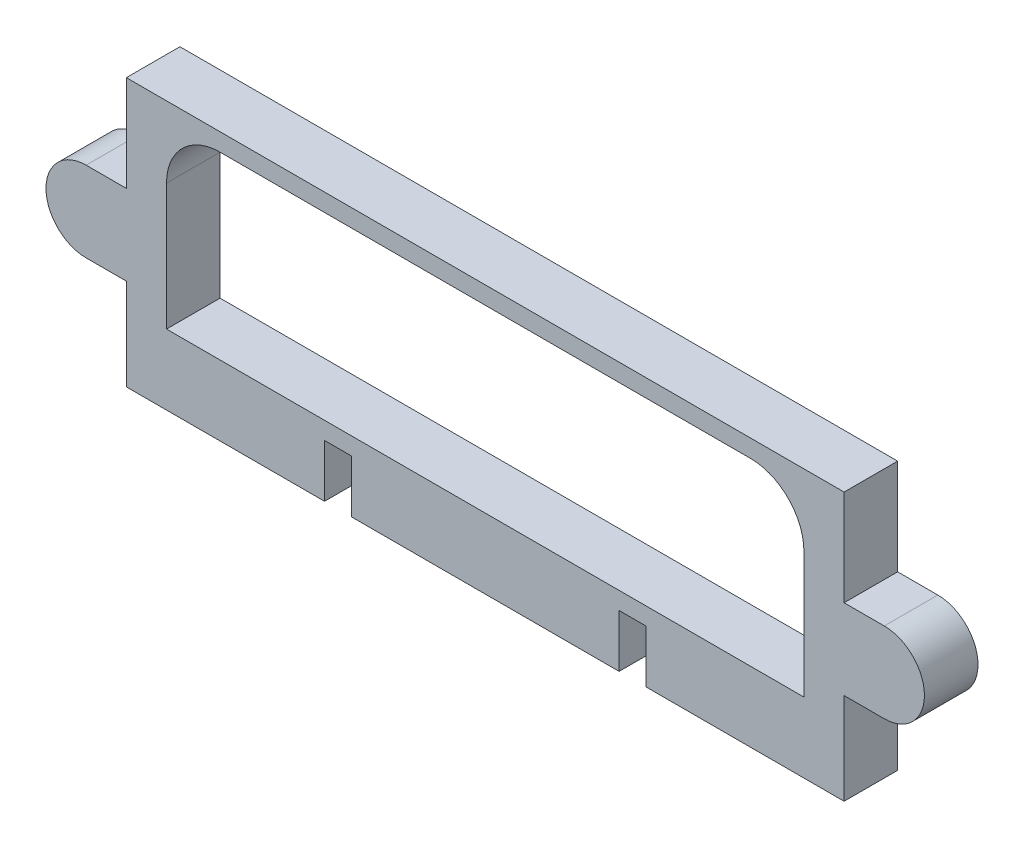
ISO-10303-21;
HEADER;
FILE_DESCRIPTION(('STEP AP214'),'2;1');
FILE_NAME('part.step','',(''),(''),'','','');
FILE_SCHEMA(('AUTOMOTIVE_DESIGN { 1 0 10303 214 1 1 1 1 }'));
ENDSEC;
DATA;
#1=APPLICATION_CONTEXT('core data for automotive mechanical design processes');
#2=APPLICATION_PROTOCOL_DEFINITION('international standard','automotive_design',2000,#1);
#3=PRODUCT_CONTEXT('',#1,'mechanical');
#4=PRODUCT('Part','Part','',(#3));
#5=PRODUCT_RELATED_PRODUCT_CATEGORY('part','',(#4));
#6=PRODUCT_DEFINITION_FORMATION('','',#4);
#7=PRODUCT_DEFINITION_CONTEXT('part definition',#1,'design');
#8=PRODUCT_DEFINITION('design','',#6,#7);
#9=PRODUCT_DEFINITION_SHAPE('','',#8);
#10=(LENGTH_UNIT() NAMED_UNIT(*) SI_UNIT(.MILLI.,.METRE.));
#11=(NAMED_UNIT(*) PLANE_ANGLE_UNIT() SI_UNIT($,.RADIAN.));
#12=(NAMED_UNIT(*) SI_UNIT($,.STERADIAN.) SOLID_ANGLE_UNIT());
#13=UNCERTAINTY_MEASURE_WITH_UNIT(LENGTH_MEASURE(1.E-05),#10,'distance_accuracy_value','');
#14=(GEOMETRIC_REPRESENTATION_CONTEXT(3) GLOBAL_UNCERTAINTY_ASSIGNED_CONTEXT((#13)) GLOBAL_UNIT_ASSIGNED_CONTEXT((#10,
#11,#12)) REPRESENTATION_CONTEXT('',''));
#15=CARTESIAN_POINT('',(0.,0.,0.));
#16=DIRECTION('',(0.,0.,1.));
#17=DIRECTION('',(1.,0.,0.));
#18=AXIS2_PLACEMENT_3D('',#15,#16,#17);
#19=CARTESIAN_POINT('',(74.5,24.5975679815042,10.));
#20=DIRECTION('',(0.,0.,-1.));
#21=DIRECTION('',(-1.,0.,0.));
#22=AXIS2_PLACEMENT_3D('',#19,#20,#21);
#23=CYLINDRICAL_SURFACE('',#22,7.50000000000001);
#24=CARTESIAN_POINT('',(74.5,24.5975679815042,0.));
#25=DIRECTION('',(0.,0.,1.));
#26=DIRECTION('',(1.,0.,0.));
#27=AXIS2_PLACEMENT_3D('',#24,#25,#26);
#28=CIRCLE('',#27,7.50000000000001);
#29=CARTESIAN_POINT('',(74.5,32.0975679815042,0.));
#30=VERTEX_POINT('',#29);
#31=CARTESIAN_POINT('',(74.5,17.0975679815042,0.));
#32=VERTEX_POINT('',#31);
#33=EDGE_CURVE('E352',#30,#32,#28,.F.);
#34=ORIENTED_EDGE('',*,*,#33,.F.);
#35=DIRECTION('',(0.,0.,-1.));
#36=VECTOR('',#35,1.);
#37=CARTESIAN_POINT('',(74.5,32.0975679815042,10.));
#38=LINE('',#37,#36);
#39=CARTESIAN_POINT('',(74.5,32.0975679815042,10.));
#40=VERTEX_POINT('',#39);
#41=EDGE_CURVE('E11',#40,#30,#38,.T.);
#42=ORIENTED_EDGE('',*,*,#41,.F.);
#43=CARTESIAN_POINT('',(74.5,24.5975679815042,10.));
#44=DIRECTION('',(0.,0.,1.));
#45=DIRECTION('',(1.,0.,0.));
#46=AXIS2_PLACEMENT_3D('',#43,#44,#45);
#47=CIRCLE('',#46,7.50000000000001);
#48=CARTESIAN_POINT('',(74.5,17.0975679815042,10.));
#49=VERTEX_POINT('',#48);
#50=EDGE_CURVE('E414',#40,#49,#47,.F.);
#51=ORIENTED_EDGE('',*,*,#50,.T.);
#52=DIRECTION('',(0.,0.,-1.));
#53=VECTOR('',#52,1.);
#54=CARTESIAN_POINT('',(74.5,17.0975679815042,10.));
#55=LINE('',#54,#53);
#56=EDGE_CURVE('E146',#49,#32,#55,.T.);
#57=ORIENTED_EDGE('',*,*,#56,.T.);
#58=EDGE_LOOP('',(#34,#42,#51,#57));
#59=FACE_BOUND('',#58,.T.);
#60=ADVANCED_FACE('F39',(#59),#23,.T.);
#61=CARTESIAN_POINT('',(0.,32.0975679815042,10.));
#62=DIRECTION('',(0.,1.,0.));
#63=DIRECTION('',(0.,0.,1.));
#64=AXIS2_PLACEMENT_3D('',#61,#62,#63);
#65=PLANE('',#64);
#66=DIRECTION('',(1.,0.,0.));
#67=VECTOR('',#66,1.);
#68=CARTESIAN_POINT('',(0.,32.0975679815042,0.));
#69=LINE('',#68,#67);
#70=CARTESIAN_POINT('',(67.,32.0975679815042,0.));
#71=VERTEX_POINT('',#70);
#72=EDGE_CURVE('E349',#71,#30,#69,.T.);
#73=ORIENTED_EDGE('',*,*,#72,.F.);
#74=DIRECTION('',(0.,0.,-1.));
#75=VECTOR('',#74,1.);
#76=CARTESIAN_POINT('',(67.,32.0975679815042,10.));
#77=LINE('',#76,#75);
#78=CARTESIAN_POINT('',(67.,32.0975679815042,10.));
#79=VERTEX_POINT('',#78);
#80=EDGE_CURVE('E49',#79,#71,#77,.T.);
#81=ORIENTED_EDGE('',*,*,#80,.F.);
#82=DIRECTION('',(1.,0.,0.));
#83=VECTOR('',#82,1.);
#84=CARTESIAN_POINT('',(0.,32.0975679815042,10.));
#85=LINE('',#84,#83);
#86=EDGE_CURVE('E411',#79,#40,#85,.T.);
#87=ORIENTED_EDGE('',*,*,#86,.T.);
#88=ORIENTED_EDGE('',*,*,#41,.T.);
#89=EDGE_LOOP('',(#73,#81,#87,#88));
#90=FACE_BOUND('',#89,.T.);
#91=ADVANCED_FACE('F460',(#90),#65,.T.);
#92=CARTESIAN_POINT('',(67.,0.,10.));
#93=DIRECTION('',(-1.,0.,0.));
#94=DIRECTION('',(0.,0.,1.));
#95=AXIS2_PLACEMENT_3D('',#92,#93,#94);
#96=PLANE('',#95);
#97=DIRECTION('',(0.,1.,0.));
#98=VECTOR('',#97,1.);
#99=CARTESIAN_POINT('',(67.,0.,0.));
#100=LINE('',#99,#98);
#101=CARTESIAN_POINT('',(67.,50.,0.));
#102=VERTEX_POINT('',#101);
#103=EDGE_CURVE('E346',#71,#102,#100,.T.);
#104=ORIENTED_EDGE('',*,*,#103,.T.);
#105=DIRECTION('',(0.,0.,-1.));
#106=VECTOR('',#105,1.);
#107=CARTESIAN_POINT('',(67.,50.,10.));
#108=LINE('',#107,#106);
#109=CARTESIAN_POINT('',(67.,50.,10.));
#110=VERTEX_POINT('',#109);
#111=EDGE_CURVE('E279',#110,#102,#108,.T.);
#112=ORIENTED_EDGE('',*,*,#111,.F.);
#113=DIRECTION('',(0.,1.,0.));
#114=VECTOR('',#113,1.);
#115=CARTESIAN_POINT('',(67.,0.,10.));
#116=LINE('',#115,#114);
#117=EDGE_CURVE('E409',#79,#110,#116,.T.);
#118=ORIENTED_EDGE('',*,*,#117,.F.);
#119=ORIENTED_EDGE('',*,*,#80,.T.);
#120=EDGE_LOOP('',(#104,#112,#118,#119));
#121=FACE_BOUND('',#120,.T.);
#122=ADVANCED_FACE('F464',(#121),#96,.F.);
#123=CARTESIAN_POINT('',(0.,50.,10.));
#124=DIRECTION('',(0.,1.,0.));
#125=DIRECTION('',(0.,0.,1.));
#126=AXIS2_PLACEMENT_3D('',#123,#124,#125);
#127=PLANE('',#126);
#128=DIRECTION('',(1.,0.,0.));
#129=VECTOR('',#128,1.);
#130=CARTESIAN_POINT('',(0.,50.,0.));
#131=LINE('',#130,#129);
#132=CARTESIAN_POINT('',(-67.,50.,0.));
#133=VERTEX_POINT('',#132);
#134=EDGE_CURVE('E343',#133,#102,#131,.T.);
#135=ORIENTED_EDGE('',*,*,#134,.F.);
#136=DIRECTION('',(0.,0.,-1.));
#137=VECTOR('',#136,1.);
#138=CARTESIAN_POINT('',(-67.,50.,10.));
#139=LINE('',#138,#137);
#140=CARTESIAN_POINT('',(-67.,50.,10.));
#141=VERTEX_POINT('',#140);
#142=EDGE_CURVE('E277',#141,#133,#139,.T.);
#143=ORIENTED_EDGE('',*,*,#142,.F.);
#144=DIRECTION('',(1.,0.,0.));
#145=VECTOR('',#144,1.);
#146=CARTESIAN_POINT('',(0.,50.,10.));
#147=LINE('',#146,#145);
#148=EDGE_CURVE('E406',#141,#110,#147,.T.);
#149=ORIENTED_EDGE('',*,*,#148,.T.);
#150=ORIENTED_EDGE('',*,*,#111,.T.);
#151=EDGE_LOOP('',(#135,#143,#149,#150));
#152=FACE_BOUND('',#151,.T.);
#153=ADVANCED_FACE('F470',(#152),#127,.T.);
#154=CARTESIAN_POINT('',(-67.,0.,10.));
#155=DIRECTION('',(-1.,0.,0.));
#156=DIRECTION('',(0.,0.,1.));
#157=AXIS2_PLACEMENT_3D('',#154,#155,#156);
#158=PLANE('',#157);
#159=DIRECTION('',(0.,1.,0.));
#160=VECTOR('',#159,1.);
#161=CARTESIAN_POINT('',(-67.,0.,0.));
#162=LINE('',#161,#160);
#163=CARTESIAN_POINT('',(-67.,32.0975679815042,0.));
#164=VERTEX_POINT('',#163);
#165=EDGE_CURVE('E340',#164,#133,#162,.T.);
#166=ORIENTED_EDGE('',*,*,#165,.F.);
#167=DIRECTION('',(0.,0.,-1.));
#168=VECTOR('',#167,1.);
#169=CARTESIAN_POINT('',(-67.,32.0975679815042,10.));
#170=LINE('',#169,#168);
#171=CARTESIAN_POINT('',(-67.,32.0975679815042,10.));
#172=VERTEX_POINT('',#171);
#173=EDGE_CURVE('E275',#172,#164,#170,.T.);
#174=ORIENTED_EDGE('',*,*,#173,.F.);
#175=DIRECTION('',(0.,1.,0.));
#176=VECTOR('',#175,1.);
#177=CARTESIAN_POINT('',(-67.,0.,10.));
#178=LINE('',#177,#176);
#179=EDGE_CURVE('E403',#172,#141,#178,.T.);
#180=ORIENTED_EDGE('',*,*,#179,.T.);
#181=ORIENTED_EDGE('',*,*,#142,.T.);
#182=EDGE_LOOP('',(#166,#174,#180,#181));
#183=FACE_BOUND('',#182,.T.);
#184=ADVANCED_FACE('F474',(#183),#158,.T.);
#185=CARTESIAN_POINT('',(0.,32.0975679815042,10.));
#186=DIRECTION('',(0.,-1.,0.));
#187=DIRECTION('',(0.,0.,-1.));
#188=AXIS2_PLACEMENT_3D('',#185,#186,#187);
#189=PLANE('',#188);
#190=DIRECTION('',(-1.,0.,0.));
#191=VECTOR('',#190,1.);
#192=CARTESIAN_POINT('',(0.,32.0975679815042,0.));
#193=LINE('',#192,#191);
#194=CARTESIAN_POINT('',(-74.5,32.0975679815042,0.));
#195=VERTEX_POINT('',#194);
#196=EDGE_CURVE('E337',#164,#195,#193,.T.);
#197=ORIENTED_EDGE('',*,*,#196,.T.);
#198=DIRECTION('',(0.,0.,-1.));
#199=VECTOR('',#198,1.);
#200=CARTESIAN_POINT('',(-74.5,32.0975679815042,10.));
#201=LINE('',#200,#199);
#202=CARTESIAN_POINT('',(-74.5,32.0975679815042,10.));
#203=VERTEX_POINT('',#202);
#204=EDGE_CURVE('E272',#203,#195,#201,.T.);
#205=ORIENTED_EDGE('',*,*,#204,.F.);
#206=DIRECTION('',(-1.,0.,0.));
#207=VECTOR('',#206,1.);
#208=CARTESIAN_POINT('',(0.,32.0975679815042,10.));
#209=LINE('',#208,#207);
#210=EDGE_CURVE('E400',#172,#203,#209,.T.);
#211=ORIENTED_EDGE('',*,*,#210,.F.);
#212=ORIENTED_EDGE('',*,*,#173,.T.);
#213=EDGE_LOOP('',(#197,#205,#211,#212));
#214=FACE_BOUND('',#213,.T.);
#215=ADVANCED_FACE('F478',(#214),#189,.F.);
#216=CARTESIAN_POINT('',(-74.5,24.5975679815042,10.));
#217=DIRECTION('',(0.,0.,-1.));
#218=DIRECTION('',(-1.,0.,0.));
#219=AXIS2_PLACEMENT_3D('',#216,#217,#218);
#220=CYLINDRICAL_SURFACE('',#219,7.50000000000001);
#221=CARTESIAN_POINT('',(-74.5,24.5975679815042,0.));
#222=DIRECTION('',(0.,0.,1.));
#223=DIRECTION('',(1.,0.,0.));
#224=AXIS2_PLACEMENT_3D('',#221,#222,#223);
#225=CIRCLE('',#224,7.50000000000001);
#226=CARTESIAN_POINT('',(-74.5,17.0975679815042,0.));
#227=VERTEX_POINT('',#226);
#228=EDGE_CURVE('E334',#195,#227,#225,.T.);
#229=ORIENTED_EDGE('',*,*,#228,.T.);
#230=DIRECTION('',(0.,0.,-1.));
#231=VECTOR('',#230,1.);
#232=CARTESIAN_POINT('',(-74.5,17.0975679815042,10.));
#233=LINE('',#232,#231);
#234=CARTESIAN_POINT('',(-74.5,17.0975679815042,10.));
#235=VERTEX_POINT('',#234);
#236=EDGE_CURVE('E270',#235,#227,#233,.T.);
#237=ORIENTED_EDGE('',*,*,#236,.F.);
#238=CARTESIAN_POINT('',(-74.5,24.5975679815042,10.));
#239=DIRECTION('',(0.,0.,1.));
#240=DIRECTION('',(1.,0.,0.));
#241=AXIS2_PLACEMENT_3D('',#238,#239,#240);
#242=CIRCLE('',#241,7.50000000000001);
#243=EDGE_CURVE('E398',#203,#235,#242,.T.);
#244=ORIENTED_EDGE('',*,*,#243,.F.);
#245=ORIENTED_EDGE('',*,*,#204,.T.);
#246=EDGE_LOOP('',(#229,#237,#244,#245));
#247=FACE_BOUND('',#246,.T.);
#248=ADVANCED_FACE('F482',(#247),#220,.T.);
#249=CARTESIAN_POINT('',(0.,17.0975679815043,10.));
#250=DIRECTION('',(0.,-1.,0.));
#251=DIRECTION('',(1.,0.,0.));
#252=AXIS2_PLACEMENT_3D('',#249,#250,#251);
#253=PLANE('',#252);
#254=DIRECTION('',(-1.,0.,0.));
#255=VECTOR('',#254,1.);
#256=CARTESIAN_POINT('',(0.,17.0975679815043,0.));
#257=LINE('',#256,#255);
#258=CARTESIAN_POINT('',(-67.,17.0975679815042,0.));
#259=VERTEX_POINT('',#258);
#260=EDGE_CURVE('E331',#259,#227,#257,.T.);
#261=ORIENTED_EDGE('',*,*,#260,.F.);
#262=DIRECTION('',(0.,0.,-1.));
#263=VECTOR('',#262,1.);
#264=CARTESIAN_POINT('',(-67.,17.0975679815042,10.));
#265=LINE('',#264,#263);
#266=CARTESIAN_POINT('',(-67.,17.0975679815042,10.));
#267=VERTEX_POINT('',#266);
#268=EDGE_CURVE('E268',#267,#259,#265,.T.);
#269=ORIENTED_EDGE('',*,*,#268,.F.);
#270=DIRECTION('',(-1.,0.,0.));
#271=VECTOR('',#270,1.);
#272=CARTESIAN_POINT('',(0.,17.0975679815043,10.));
#273=LINE('',#272,#271);
#274=EDGE_CURVE('E395',#267,#235,#273,.T.);
#275=ORIENTED_EDGE('',*,*,#274,.T.);
#276=ORIENTED_EDGE('',*,*,#236,.T.);
#277=EDGE_LOOP('',(#261,#269,#275,#276));
#278=FACE_BOUND('',#277,.T.);
#279=ADVANCED_FACE('F486',(#278),#253,.T.);
#280=CARTESIAN_POINT('',(-67.,0.,10.));
#281=DIRECTION('',(-1.,0.,0.));
#282=DIRECTION('',(0.,0.,1.));
#283=AXIS2_PLACEMENT_3D('',#280,#281,#282);
#284=PLANE('',#283);
#285=DIRECTION('',(0.,1.,0.));
#286=VECTOR('',#285,1.);
#287=CARTESIAN_POINT('',(-67.,0.,0.));
#288=LINE('',#287,#286);
#289=CARTESIAN_POINT('',(-67.,0.,0.));
#290=VERTEX_POINT('',#289);
#291=EDGE_CURVE('E328',#290,#259,#288,.T.);
#292=ORIENTED_EDGE('',*,*,#291,.F.);
#293=DIRECTION('',(0.,0.,-1.));
#294=VECTOR('',#293,1.);
#295=CARTESIAN_POINT('',(-67.,0.,10.));
#296=LINE('',#295,#294);
#297=CARTESIAN_POINT('',(-67.,0.,10.));
#298=VERTEX_POINT('',#297);
#299=EDGE_CURVE('E266',#298,#290,#296,.T.);
#300=ORIENTED_EDGE('',*,*,#299,.F.);
#301=DIRECTION('',(0.,1.,0.));
#302=VECTOR('',#301,1.);
#303=CARTESIAN_POINT('',(-67.,0.,10.));
#304=LINE('',#303,#302);
#305=EDGE_CURVE('E392',#298,#267,#304,.T.);
#306=ORIENTED_EDGE('',*,*,#305,.T.);
#307=ORIENTED_EDGE('',*,*,#268,.T.);
#308=EDGE_LOOP('',(#292,#300,#306,#307));
#309=FACE_BOUND('',#308,.T.);
#310=ADVANCED_FACE('F490',(#309),#284,.T.);
#311=CARTESIAN_POINT('',(0.,0.,10.));
#312=DIRECTION('',(0.,-1.,0.));
#313=DIRECTION('',(0.,0.,-1.));
#314=AXIS2_PLACEMENT_3D('',#311,#312,#313);
#315=PLANE('',#314);
#316=DIRECTION('',(-1.,0.,0.));
#317=VECTOR('',#316,1.);
#318=CARTESIAN_POINT('',(0.,0.,0.));
#319=LINE('',#318,#317);
#320=CARTESIAN_POINT('',(-30.,0.,0.));
#321=VERTEX_POINT('',#320);
#322=EDGE_CURVE('E325',#321,#290,#319,.T.);
#323=ORIENTED_EDGE('',*,*,#322,.F.);
#324=DIRECTION('',(0.,0.,-1.));
#325=VECTOR('',#324,1.);
#326=CARTESIAN_POINT('',(-30.,0.,10.));
#327=LINE('',#326,#325);
#328=CARTESIAN_POINT('',(-30.,0.,10.));
#329=VERTEX_POINT('',#328);
#330=EDGE_CURVE('E264',#329,#321,#327,.T.);
#331=ORIENTED_EDGE('',*,*,#330,.F.);
#332=DIRECTION('',(-1.,0.,0.));
#333=VECTOR('',#332,1.);
#334=CARTESIAN_POINT('',(0.,0.,10.));
#335=LINE('',#334,#333);
#336=EDGE_CURVE('E389',#329,#298,#335,.T.);
#337=ORIENTED_EDGE('',*,*,#336,.T.);
#338=ORIENTED_EDGE('',*,*,#299,.T.);
#339=EDGE_LOOP('',(#323,#331,#337,#338));
#340=FACE_BOUND('',#339,.T.);
#341=ADVANCED_FACE('F494',(#340),#315,.T.);
#342=CARTESIAN_POINT('',(-30.,0.,10.));
#343=DIRECTION('',(1.,0.,0.));
#344=DIRECTION('',(0.,0.,-1.));
#345=AXIS2_PLACEMENT_3D('',#342,#343,#344);
#346=PLANE('',#345);
#347=DIRECTION('',(0.,-1.,0.));
#348=VECTOR('',#347,1.);
#349=CARTESIAN_POINT('',(-30.,0.,0.));
#350=LINE('',#349,#348);
#351=CARTESIAN_POINT('',(-30.,9.8443485034029,0.));
#352=VERTEX_POINT('',#351);
#353=EDGE_CURVE('E322',#352,#321,#350,.T.);
#354=ORIENTED_EDGE('',*,*,#353,.F.);
#355=DIRECTION('',(0.,0.,-1.));
#356=VECTOR('',#355,1.);
#357=CARTESIAN_POINT('',(-30.,9.8443485034029,10.));
#358=LINE('',#357,#356);
#359=CARTESIAN_POINT('',(-30.,9.8443485034029,10.));
#360=VERTEX_POINT('',#359);
#361=EDGE_CURVE('E262',#360,#352,#358,.T.);
#362=ORIENTED_EDGE('',*,*,#361,.F.);
#363=DIRECTION('',(0.,-1.,0.));
#364=VECTOR('',#363,1.);
#365=CARTESIAN_POINT('',(-30.,0.,10.));
#366=LINE('',#365,#364);
#367=EDGE_CURVE('E386',#360,#329,#366,.T.);
#368=ORIENTED_EDGE('',*,*,#367,.T.);
#369=ORIENTED_EDGE('',*,*,#330,.T.);
#370=EDGE_LOOP('',(#354,#362,#368,#369));
#371=FACE_BOUND('',#370,.T.);
#372=ADVANCED_FACE('F498',(#371),#346,.T.);
#373=CARTESIAN_POINT('',(0.,9.8443485034029,10.));
#374=DIRECTION('',(0.,-1.,0.));
#375=DIRECTION('',(0.,0.,-1.));
#376=AXIS2_PLACEMENT_3D('',#373,#374,#375);
#377=PLANE('',#376);
#378=DIRECTION('',(-1.,0.,0.));
#379=VECTOR('',#378,1.);
#380=CARTESIAN_POINT('',(0.,9.8443485034029,0.));
#381=LINE('',#380,#379);
#382=CARTESIAN_POINT('',(-25.,9.8443485034029,0.));
#383=VERTEX_POINT('',#382);
#384=EDGE_CURVE('E319',#383,#352,#381,.T.);
#385=ORIENTED_EDGE('',*,*,#384,.F.);
#386=DIRECTION('',(0.,0.,-1.));
#387=VECTOR('',#386,1.);
#388=CARTESIAN_POINT('',(-25.,9.8443485034029,10.));
#389=LINE('',#388,#387);
#390=CARTESIAN_POINT('',(-25.,9.8443485034029,10.));
#391=VERTEX_POINT('',#390);
#392=EDGE_CURVE('E260',#391,#383,#389,.T.);
#393=ORIENTED_EDGE('',*,*,#392,.F.);
#394=DIRECTION('',(-1.,0.,0.));
#395=VECTOR('',#394,1.);
#396=CARTESIAN_POINT('',(0.,9.8443485034029,10.));
#397=LINE('',#396,#395);
#398=EDGE_CURVE('E383',#391,#360,#397,.T.);
#399=ORIENTED_EDGE('',*,*,#398,.T.);
#400=ORIENTED_EDGE('',*,*,#361,.T.);
#401=EDGE_LOOP('',(#385,#393,#399,#400));
#402=FACE_BOUND('',#401,.T.);
#403=ADVANCED_FACE('F502',(#402),#377,.T.);
#404=CARTESIAN_POINT('',(-25.,0.,10.));
#405=DIRECTION('',(-1.,0.,0.));
#406=DIRECTION('',(0.,0.,1.));
#407=AXIS2_PLACEMENT_3D('',#404,#405,#406);
#408=PLANE('',#407);
#409=DIRECTION('',(0.,1.,0.));
#410=VECTOR('',#409,1.);
#411=CARTESIAN_POINT('',(-25.,0.,0.));
#412=LINE('',#411,#410);
#413=CARTESIAN_POINT('',(-25.,0.,0.));
#414=VERTEX_POINT('',#413);
#415=EDGE_CURVE('E316',#414,#383,#412,.T.);
#416=ORIENTED_EDGE('',*,*,#415,.F.);
#417=DIRECTION('',(0.,0.,-1.));
#418=VECTOR('',#417,1.);
#419=CARTESIAN_POINT('',(-25.,0.,10.));
#420=LINE('',#419,#418);
#421=CARTESIAN_POINT('',(-25.,0.,10.));
#422=VERTEX_POINT('',#421);
#423=EDGE_CURVE('E258',#422,#414,#420,.T.);
#424=ORIENTED_EDGE('',*,*,#423,.F.);
#425=DIRECTION('',(0.,1.,0.));
#426=VECTOR('',#425,1.);
#427=CARTESIAN_POINT('',(-25.,0.,10.));
#428=LINE('',#427,#426);
#429=EDGE_CURVE('E380',#422,#391,#428,.T.);
#430=ORIENTED_EDGE('',*,*,#429,.T.);
#431=ORIENTED_EDGE('',*,*,#392,.T.);
#432=EDGE_LOOP('',(#416,#424,#430,#431));
#433=FACE_BOUND('',#432,.T.);
#434=ADVANCED_FACE('F506',(#433),#408,.T.);
#435=CARTESIAN_POINT('',(0.,0.,10.));
#436=DIRECTION('',(0.,1.,0.));
#437=DIRECTION('',(-1.,0.,0.));
#438=AXIS2_PLACEMENT_3D('',#435,#436,#437);
#439=PLANE('',#438);
#440=DIRECTION('',(1.,0.,0.));
#441=VECTOR('',#440,1.);
#442=CARTESIAN_POINT('',(0.,0.,0.));
#443=LINE('',#442,#441);
#444=CARTESIAN_POINT('',(25.,0.,0.));
#445=VERTEX_POINT('',#444);
#446=EDGE_CURVE('E313',#414,#445,#443,.T.);
#447=ORIENTED_EDGE('',*,*,#446,.T.);
#448=DIRECTION('',(0.,0.,-1.));
#449=VECTOR('',#448,1.);
#450=CARTESIAN_POINT('',(25.,0.,10.));
#451=LINE('',#450,#449);
#452=CARTESIAN_POINT('',(25.,0.,10.));
#453=VERTEX_POINT('',#452);
#454=EDGE_CURVE('E255',#453,#445,#451,.T.);
#455=ORIENTED_EDGE('',*,*,#454,.F.);
#456=DIRECTION('',(1.,0.,0.));
#457=VECTOR('',#456,1.);
#458=CARTESIAN_POINT('',(0.,0.,10.));
#459=LINE('',#458,#457);
#460=EDGE_CURVE('E377',#422,#453,#459,.T.);
#461=ORIENTED_EDGE('',*,*,#460,.F.);
#462=ORIENTED_EDGE('',*,*,#423,.T.);
#463=EDGE_LOOP('',(#447,#455,#461,#462));
#464=FACE_BOUND('',#463,.T.);
#465=ADVANCED_FACE('F510',(#464),#439,.F.);
#466=CARTESIAN_POINT('',(25.,0.,10.));
#467=DIRECTION('',(-1.,0.,0.));
#468=DIRECTION('',(0.,0.,1.));
#469=AXIS2_PLACEMENT_3D('',#466,#467,#468);
#470=PLANE('',#469);
#471=DIRECTION('',(0.,1.,0.));
#472=VECTOR('',#471,1.);
#473=CARTESIAN_POINT('',(25.,0.,0.));
#474=LINE('',#473,#472);
#475=CARTESIAN_POINT('',(25.,9.8443485034029,0.));
#476=VERTEX_POINT('',#475);
#477=EDGE_CURVE('E310',#445,#476,#474,.T.);
#478=ORIENTED_EDGE('',*,*,#477,.T.);
#479=DIRECTION('',(0.,0.,-1.));
#480=VECTOR('',#479,1.);
#481=CARTESIAN_POINT('',(25.,9.8443485034029,10.));
#482=LINE('',#481,#480);
#483=CARTESIAN_POINT('',(25.,9.8443485034029,10.));
#484=VERTEX_POINT('',#483);
#485=EDGE_CURVE('E252',#484,#476,#482,.T.);
#486=ORIENTED_EDGE('',*,*,#485,.F.);
#487=DIRECTION('',(0.,1.,0.));
#488=VECTOR('',#487,1.);
#489=CARTESIAN_POINT('',(25.,0.,10.));
#490=LINE('',#489,#488);
#491=EDGE_CURVE('E374',#453,#484,#490,.T.);
#492=ORIENTED_EDGE('',*,*,#491,.F.);
#493=ORIENTED_EDGE('',*,*,#454,.T.);
#494=EDGE_LOOP('',(#478,#486,#492,#493));
#495=FACE_BOUND('',#494,.T.);
#496=ADVANCED_FACE('F514',(#495),#470,.F.);
#497=CARTESIAN_POINT('',(0.,9.8443485034029,10.));
#498=DIRECTION('',(0.,1.,0.));
#499=DIRECTION('',(0.,0.,1.));
#500=AXIS2_PLACEMENT_3D('',#497,#498,#499);
#501=PLANE('',#500);
#502=DIRECTION('',(1.,0.,0.));
#503=VECTOR('',#502,1.);
#504=CARTESIAN_POINT('',(0.,9.8443485034029,0.));
#505=LINE('',#504,#503);
#506=CARTESIAN_POINT('',(30.,9.8443485034029,0.));
#507=VERTEX_POINT('',#506);
#508=EDGE_CURVE('E307',#476,#507,#505,.T.);
#509=ORIENTED_EDGE('',*,*,#508,.T.);
#510=DIRECTION('',(0.,0.,-1.));
#511=VECTOR('',#510,1.);
#512=CARTESIAN_POINT('',(30.,9.8443485034029,10.));
#513=LINE('',#512,#511);
#514=CARTESIAN_POINT('',(30.,9.8443485034029,10.));
#515=VERTEX_POINT('',#514);
#516=EDGE_CURVE('E245',#515,#507,#513,.T.);
#517=ORIENTED_EDGE('',*,*,#516,.F.);
#518=DIRECTION('',(1.,0.,0.));
#519=VECTOR('',#518,1.);
#520=CARTESIAN_POINT('',(0.,9.8443485034029,10.));
#521=LINE('',#520,#519);
#522=EDGE_CURVE('E372',#484,#515,#521,.T.);
#523=ORIENTED_EDGE('',*,*,#522,.F.);
#524=ORIENTED_EDGE('',*,*,#485,.T.);
#525=EDGE_LOOP('',(#509,#517,#523,#524));
#526=FACE_BOUND('',#525,.T.);
#527=ADVANCED_FACE('F518',(#526),#501,.F.);
#528=CARTESIAN_POINT('',(30.,0.,10.));
#529=DIRECTION('',(1.,0.,0.));
#530=DIRECTION('',(0.,0.,-1.));
#531=AXIS2_PLACEMENT_3D('',#528,#529,#530);
#532=PLANE('',#531);
#533=DIRECTION('',(0.,-1.,0.));
#534=VECTOR('',#533,1.);
#535=CARTESIAN_POINT('',(30.,0.,0.));
#536=LINE('',#535,#534);
#537=CARTESIAN_POINT('',(30.,0.,0.));
#538=VERTEX_POINT('',#537);
#539=EDGE_CURVE('E304',#507,#538,#536,.T.);
#540=ORIENTED_EDGE('',*,*,#539,.T.);
#541=DIRECTION('',(0.,0.,-1.));
#542=VECTOR('',#541,1.);
#543=CARTESIAN_POINT('',(30.,0.,10.));
#544=LINE('',#543,#542);
#545=CARTESIAN_POINT('',(30.,0.,10.));
#546=VERTEX_POINT('',#545);
#547=EDGE_CURVE('E243',#546,#538,#544,.T.);
#548=ORIENTED_EDGE('',*,*,#547,.F.);
#549=DIRECTION('',(0.,-1.,0.));
#550=VECTOR('',#549,1.);
#551=CARTESIAN_POINT('',(30.,0.,10.));
#552=LINE('',#551,#550);
#553=EDGE_CURVE('E236',#515,#546,#552,.T.);
#554=ORIENTED_EDGE('',*,*,#553,.F.);
#555=ORIENTED_EDGE('',*,*,#516,.T.);
#556=EDGE_LOOP('',(#540,#548,#554,#555));
#557=FACE_BOUND('',#556,.T.);
#558=ADVANCED_FACE('F522',(#557),#532,.F.);
#559=CARTESIAN_POINT('',(0.,0.,10.));
#560=DIRECTION('',(0.,1.,0.));
#561=DIRECTION('',(0.,0.,1.));
#562=AXIS2_PLACEMENT_3D('',#559,#560,#561);
#563=PLANE('',#562);
#564=DIRECTION('',(1.,0.,0.));
#565=VECTOR('',#564,1.);
#566=CARTESIAN_POINT('',(0.,0.,0.));
#567=LINE('',#566,#565);
#568=CARTESIAN_POINT('',(67.,0.,0.));
#569=VERTEX_POINT('',#568);
#570=EDGE_CURVE('E242',#538,#569,#567,.T.);
#571=ORIENTED_EDGE('',*,*,#570,.T.);
#572=DIRECTION('',(0.,0.,-1.));
#573=VECTOR('',#572,1.);
#574=CARTESIAN_POINT('',(67.,0.,10.));
#575=LINE('',#574,#573);
#576=CARTESIAN_POINT('',(67.,0.,10.));
#577=VERTEX_POINT('',#576);
#578=EDGE_CURVE('E228',#577,#569,#575,.T.);
#579=ORIENTED_EDGE('',*,*,#578,.F.);
#580=DIRECTION('',(1.,0.,0.));
#581=VECTOR('',#580,1.);
#582=CARTESIAN_POINT('',(0.,0.,10.));
#583=LINE('',#582,#581);
#584=EDGE_CURVE('E231',#546,#577,#583,.T.);
#585=ORIENTED_EDGE('',*,*,#584,.F.);
#586=ORIENTED_EDGE('',*,*,#547,.T.);
#587=EDGE_LOOP('',(#571,#579,#585,#586));
#588=FACE_BOUND('',#587,.T.);
#589=ADVANCED_FACE('F241',(#588),#563,.F.);
#590=CARTESIAN_POINT('',(67.,0.,10.));
#591=DIRECTION('',(-1.,0.,0.));
#592=DIRECTION('',(0.,0.,1.));
#593=AXIS2_PLACEMENT_3D('',#590,#591,#592);
#594=PLANE('',#593);
#595=DIRECTION('',(0.,1.,0.));
#596=VECTOR('',#595,1.);
#597=CARTESIAN_POINT('',(67.,0.,0.));
#598=LINE('',#597,#596);
#599=CARTESIAN_POINT('',(67.,17.0975679815042,0.));
#600=VERTEX_POINT('',#599);
#601=EDGE_CURVE('E301',#569,#600,#598,.T.);
#602=ORIENTED_EDGE('',*,*,#601,.T.);
#603=DIRECTION('',(0.,0.,-1.));
#604=VECTOR('',#603,1.);
#605=CARTESIAN_POINT('',(67.,17.0975679815042,10.));
#606=LINE('',#605,#604);
#607=CARTESIAN_POINT('',(67.,17.0975679815042,10.));
#608=VERTEX_POINT('',#607);
#609=EDGE_CURVE('E230',#608,#600,#606,.T.);
#610=ORIENTED_EDGE('',*,*,#609,.F.);
#611=DIRECTION('',(0.,1.,0.));
#612=VECTOR('',#611,1.);
#613=CARTESIAN_POINT('',(67.,0.,10.));
#614=LINE('',#613,#612);
#615=EDGE_CURVE('E223',#577,#608,#614,.T.);
#616=ORIENTED_EDGE('',*,*,#615,.F.);
#617=ORIENTED_EDGE('',*,*,#578,.T.);
#618=EDGE_LOOP('',(#602,#610,#616,#617));
#619=FACE_BOUND('',#618,.T.);
#620=ADVANCED_FACE('F226',(#619),#594,.F.);
#621=CARTESIAN_POINT('',(49.5,36.7,10.));
#622=DIRECTION('',(0.,0.,-1.));
#623=DIRECTION('',(-1.,0.,0.));
#624=AXIS2_PLACEMENT_3D('',#621,#622,#623);
#625=CYLINDRICAL_SURFACE('',#624,10.);
#626=CARTESIAN_POINT('',(49.5,36.7,0.));
#627=DIRECTION('',(0.,0.,1.));
#628=DIRECTION('',(1.,0.,0.));
#629=AXIS2_PLACEMENT_3D('',#626,#627,#628);
#630=CIRCLE('',#629,10.);
#631=CARTESIAN_POINT('',(59.5,36.6999999999999,0.));
#632=VERTEX_POINT('',#631);
#633=CARTESIAN_POINT('',(49.4999999999999,46.7,0.));
#634=VERTEX_POINT('',#633);
#635=EDGE_CURVE('E367',#632,#634,#630,.T.);
#636=ORIENTED_EDGE('',*,*,#635,.F.);
#637=DIRECTION('',(0.,0.,-1.));
#638=VECTOR('',#637,1.);
#639=CARTESIAN_POINT('',(59.5,36.6999999999999,10.));
#640=LINE('',#639,#638);
#641=CARTESIAN_POINT('',(59.5,36.6999999999999,10.));
#642=VERTEX_POINT('',#641);
#643=EDGE_CURVE('E43',#642,#632,#640,.T.);
#644=ORIENTED_EDGE('',*,*,#643,.F.);
#645=CARTESIAN_POINT('',(49.5,36.7,10.));
#646=DIRECTION('',(0.,0.,1.));
#647=DIRECTION('',(1.,0.,0.));
#648=AXIS2_PLACEMENT_3D('',#645,#646,#647);
#649=CIRCLE('',#648,10.);
#650=CARTESIAN_POINT('',(49.4999999999999,46.7,10.));
#651=VERTEX_POINT('',#650);
#652=EDGE_CURVE('E300',#642,#651,#649,.T.);
#653=ORIENTED_EDGE('',*,*,#652,.T.);
#654=DIRECTION('',(0.,0.,-1.));
#655=VECTOR('',#654,1.);
#656=CARTESIAN_POINT('',(49.4999999999999,46.7,10.));
#657=LINE('',#656,#655);
#658=EDGE_CURVE('E282',#651,#634,#657,.T.);
#659=ORIENTED_EDGE('',*,*,#658,.T.);
#660=EDGE_LOOP('',(#636,#644,#653,#659));
#661=FACE_BOUND('',#660,.T.);
#662=ADVANCED_FACE('F41',(#661),#625,.F.);
#663=CARTESIAN_POINT('',(59.5,0.,10.));
#664=DIRECTION('',(-1.,0.,0.));
#665=DIRECTION('',(0.,0.,1.));
#666=AXIS2_PLACEMENT_3D('',#663,#664,#665);
#667=PLANE('',#666);
#668=DIRECTION('',(0.,1.,0.));
#669=VECTOR('',#668,1.);
#670=CARTESIAN_POINT('',(59.5,0.,0.));
#671=LINE('',#670,#669);
#672=CARTESIAN_POINT('',(59.5,13.1,0.));
#673=VERTEX_POINT('',#672);
#674=EDGE_CURVE('E364',#673,#632,#671,.T.);
#675=ORIENTED_EDGE('',*,*,#674,.F.);
#676=DIRECTION('',(0.,0.,-1.));
#677=VECTOR('',#676,1.);
#678=CARTESIAN_POINT('',(59.5,13.1,10.));
#679=LINE('',#678,#677);
#680=CARTESIAN_POINT('',(59.5,13.1,10.));
#681=VERTEX_POINT('',#680);
#682=EDGE_CURVE('E291',#681,#673,#679,.T.);
#683=ORIENTED_EDGE('',*,*,#682,.F.);
#684=DIRECTION('',(0.,1.,0.));
#685=VECTOR('',#684,1.);
#686=CARTESIAN_POINT('',(59.5,0.,10.));
#687=LINE('',#686,#685);
#688=EDGE_CURVE('E424',#681,#642,#687,.T.);
#689=ORIENTED_EDGE('',*,*,#688,.T.);
#690=ORIENTED_EDGE('',*,*,#643,.T.);
#691=EDGE_LOOP('',(#675,#683,#689,#690));
#692=FACE_BOUND('',#691,.T.);
#693=ADVANCED_FACE('F431',(#692),#667,.T.);
#694=CARTESIAN_POINT('',(0.,13.1,10.));
#695=DIRECTION('',(0.,1.,0.));
#696=DIRECTION('',(0.,0.,1.));
#697=AXIS2_PLACEMENT_3D('',#694,#695,#696);
#698=PLANE('',#697);
#699=DIRECTION('',(1.,0.,0.));
#700=VECTOR('',#699,1.);
#701=CARTESIAN_POINT('',(0.,13.1,0.));
#702=LINE('',#701,#700);
#703=CARTESIAN_POINT('',(-59.5,13.1,0.));
#704=VERTEX_POINT('',#703);
#705=EDGE_CURVE('E361',#704,#673,#702,.T.);
#706=ORIENTED_EDGE('',*,*,#705,.F.);
#707=DIRECTION('',(0.,0.,-1.));
#708=VECTOR('',#707,1.);
#709=CARTESIAN_POINT('',(-59.5,13.1,10.));
#710=LINE('',#709,#708);
#711=CARTESIAN_POINT('',(-59.5,13.1,10.));
#712=VERTEX_POINT('',#711);
#713=EDGE_CURVE('E290',#712,#704,#710,.T.);
#714=ORIENTED_EDGE('',*,*,#713,.F.);
#715=DIRECTION('',(1.,0.,0.));
#716=VECTOR('',#715,1.);
#717=CARTESIAN_POINT('',(0.,13.1,10.));
#718=LINE('',#717,#716);
#719=EDGE_CURVE('E422',#712,#681,#718,.T.);
#720=ORIENTED_EDGE('',*,*,#719,.T.);
#721=ORIENTED_EDGE('',*,*,#682,.T.);
#722=EDGE_LOOP('',(#706,#714,#720,#721));
#723=FACE_BOUND('',#722,.T.);
#724=ADVANCED_FACE('F436',(#723),#698,.T.);
#725=CARTESIAN_POINT('',(-59.5,0.,10.));
#726=DIRECTION('',(-1.,0.,0.));
#727=DIRECTION('',(0.,0.,1.));
#728=AXIS2_PLACEMENT_3D('',#725,#726,#727);
#729=PLANE('',#728);
#730=DIRECTION('',(0.,1.,0.));
#731=VECTOR('',#730,1.);
#732=CARTESIAN_POINT('',(-59.5,0.,0.));
#733=LINE('',#732,#731);
#734=CARTESIAN_POINT('',(-59.5,36.7,0.));
#735=VERTEX_POINT('',#734);
#736=EDGE_CURVE('E359',#704,#735,#733,.T.);
#737=ORIENTED_EDGE('',*,*,#736,.T.);
#738=DIRECTION('',(0.,0.,-1.));
#739=VECTOR('',#738,1.);
#740=CARTESIAN_POINT('',(-59.5,36.7,10.));
#741=LINE('',#740,#739);
#742=CARTESIAN_POINT('',(-59.5,36.7,10.));
#743=VERTEX_POINT('',#742);
#744=EDGE_CURVE('E287',#743,#735,#741,.T.);
#745=ORIENTED_EDGE('',*,*,#744,.F.);
#746=DIRECTION('',(0.,1.,0.));
#747=VECTOR('',#746,1.);
#748=CARTESIAN_POINT('',(-59.5,0.,10.));
#749=LINE('',#748,#747);
#750=EDGE_CURVE('E420',#712,#743,#749,.T.);
#751=ORIENTED_EDGE('',*,*,#750,.F.);
#752=ORIENTED_EDGE('',*,*,#713,.T.);
#753=EDGE_LOOP('',(#737,#745,#751,#752));
#754=FACE_BOUND('',#753,.T.);
#755=ADVANCED_FACE('F440',(#754),#729,.F.);
#756=CARTESIAN_POINT('',(-49.5,36.7,10.));
#757=DIRECTION('',(0.,0.,-1.));
#758=DIRECTION('',(-1.,0.,0.));
#759=AXIS2_PLACEMENT_3D('',#756,#757,#758);
#760=CYLINDRICAL_SURFACE('',#759,10.);
#761=CARTESIAN_POINT('',(-49.5,36.7,0.));
#762=DIRECTION('',(0.,0.,1.));
#763=DIRECTION('',(1.,0.,0.));
#764=AXIS2_PLACEMENT_3D('',#761,#762,#763);
#765=CIRCLE('',#764,10.);
#766=CARTESIAN_POINT('',(-49.5,46.7,0.));
#767=VERTEX_POINT('',#766);
#768=EDGE_CURVE('E357',#735,#767,#765,.F.);
#769=ORIENTED_EDGE('',*,*,#768,.T.);
#770=DIRECTION('',(0.,0.,-1.));
#771=VECTOR('',#770,1.);
#772=CARTESIAN_POINT('',(-49.5,46.7,10.));
#773=LINE('',#772,#771);
#774=CARTESIAN_POINT('',(-49.5,46.7,10.));
#775=VERTEX_POINT('',#774);
#776=EDGE_CURVE('E284',#775,#767,#773,.T.);
#777=ORIENTED_EDGE('',*,*,#776,.F.);
#778=CARTESIAN_POINT('',(-49.5,36.7,10.));
#779=DIRECTION('',(0.,0.,1.));
#780=DIRECTION('',(1.,0.,0.));
#781=AXIS2_PLACEMENT_3D('',#778,#779,#780);
#782=CIRCLE('',#781,10.);
#783=EDGE_CURVE('E418',#743,#775,#782,.F.);
#784=ORIENTED_EDGE('',*,*,#783,.F.);
#785=ORIENTED_EDGE('',*,*,#744,.T.);
#786=EDGE_LOOP('',(#769,#777,#784,#785));
#787=FACE_BOUND('',#786,.T.);
#788=ADVANCED_FACE('F444',(#787),#760,.F.);
#789=CARTESIAN_POINT('',(0.,46.7,10.));
#790=DIRECTION('',(0.,1.,0.));
#791=DIRECTION('',(0.,0.,1.));
#792=AXIS2_PLACEMENT_3D('',#789,#790,#791);
#793=PLANE('',#792);
#794=DIRECTION('',(1.,0.,0.));
#795=VECTOR('',#794,1.);
#796=CARTESIAN_POINT('',(0.,46.7,0.));
#797=LINE('',#796,#795);
#798=EDGE_CURVE('E354',#767,#634,#797,.T.);
#799=ORIENTED_EDGE('',*,*,#798,.T.);
#800=ORIENTED_EDGE('',*,*,#658,.F.);
#801=DIRECTION('',(1.,0.,0.));
#802=VECTOR('',#801,1.);
#803=CARTESIAN_POINT('',(0.,46.7,10.));
#804=LINE('',#803,#802);
#805=EDGE_CURVE('E416',#775,#651,#804,.T.);
#806=ORIENTED_EDGE('',*,*,#805,.F.);
#807=ORIENTED_EDGE('',*,*,#776,.T.);
#808=EDGE_LOOP('',(#799,#800,#806,#807));
#809=FACE_BOUND('',#808,.T.);
#810=ADVANCED_FACE('F447',(#809),#793,.F.);
#811=CARTESIAN_POINT('',(0.,17.0975679815043,10.));
#812=DIRECTION('',(0.,1.,0.));
#813=DIRECTION('',(-1.,0.,0.));
#814=AXIS2_PLACEMENT_3D('',#811,#812,#813);
#815=PLANE('',#814);
#816=DIRECTION('',(1.,0.,0.));
#817=VECTOR('',#816,1.);
#818=CARTESIAN_POINT('',(0.,17.0975679815043,0.));
#819=LINE('',#818,#817);
#820=EDGE_CURVE('E139',#600,#32,#819,.T.);
#821=ORIENTED_EDGE('',*,*,#820,.T.);
#822=ORIENTED_EDGE('',*,*,#56,.F.);
#823=DIRECTION('',(1.,0.,0.));
#824=VECTOR('',#823,1.);
#825=CARTESIAN_POINT('',(0.,17.0975679815043,10.));
#826=LINE('',#825,#824);
#827=EDGE_CURVE('E58',#608,#49,#826,.T.);
#828=ORIENTED_EDGE('',*,*,#827,.F.);
#829=ORIENTED_EDGE('',*,*,#609,.T.);
#830=EDGE_LOOP('',(#821,#822,#828,#829));
#831=FACE_BOUND('',#830,.T.);
#832=ADVANCED_FACE('F449',(#831),#815,.F.);
#833=CARTESIAN_POINT('',(0.,0.,10.));
#834=DIRECTION('',(0.,0.,1.));
#835=DIRECTION('',(1.,0.,0.));
#836=AXIS2_PLACEMENT_3D('',#833,#834,#835);
#837=PLANE('',#836);
#838=ORIENTED_EDGE('',*,*,#652,.F.);
#839=ORIENTED_EDGE('',*,*,#688,.F.);
#840=ORIENTED_EDGE('',*,*,#719,.F.);
#841=ORIENTED_EDGE('',*,*,#750,.T.);
#842=ORIENTED_EDGE('',*,*,#783,.T.);
#843=ORIENTED_EDGE('',*,*,#805,.T.);
#844=EDGE_LOOP('',(#838,#839,#840,#841,#842,#843));
#845=FACE_BOUND('',#844,.T.);
#846=ORIENTED_EDGE('',*,*,#50,.F.);
#847=ORIENTED_EDGE('',*,*,#86,.F.);
#848=ORIENTED_EDGE('',*,*,#117,.T.);
#849=ORIENTED_EDGE('',*,*,#148,.F.);
#850=ORIENTED_EDGE('',*,*,#179,.F.);
#851=ORIENTED_EDGE('',*,*,#210,.T.);
#852=ORIENTED_EDGE('',*,*,#243,.T.);
#853=ORIENTED_EDGE('',*,*,#274,.F.);
#854=ORIENTED_EDGE('',*,*,#305,.F.);
#855=ORIENTED_EDGE('',*,*,#336,.F.);
#856=ORIENTED_EDGE('',*,*,#367,.F.);
#857=ORIENTED_EDGE('',*,*,#398,.F.);
#858=ORIENTED_EDGE('',*,*,#429,.F.);
#859=ORIENTED_EDGE('',*,*,#460,.T.);
#860=ORIENTED_EDGE('',*,*,#491,.T.);
#861=ORIENTED_EDGE('',*,*,#522,.T.);
#862=ORIENTED_EDGE('',*,*,#553,.T.);
#863=ORIENTED_EDGE('',*,*,#584,.T.);
#864=ORIENTED_EDGE('',*,*,#615,.T.);
#865=ORIENTED_EDGE('',*,*,#827,.T.);
#866=EDGE_LOOP('',(#846,#847,#848,#849,#850,#851,#852,#853,#854,#855,#856,#857,#858,#859,#860,
#861,#862,#863,#864,#865));
#867=FACE_BOUND('',#866,.T.);
#868=ADVANCED_FACE('F234',(#845,#867),#837,.T.);
#869=CARTESIAN_POINT('',(0.,0.,0.));
#870=DIRECTION('',(0.,0.,1.));
#871=DIRECTION('',(1.,0.,0.));
#872=AXIS2_PLACEMENT_3D('',#869,#870,#871);
#873=PLANE('',#872);
#874=ORIENTED_EDGE('',*,*,#635,.T.);
#875=ORIENTED_EDGE('',*,*,#798,.F.);
#876=ORIENTED_EDGE('',*,*,#768,.F.);
#877=ORIENTED_EDGE('',*,*,#736,.F.);
#878=ORIENTED_EDGE('',*,*,#705,.T.);
#879=ORIENTED_EDGE('',*,*,#674,.T.);
#880=EDGE_LOOP('',(#874,#875,#876,#877,#878,#879));
#881=FACE_BOUND('',#880,.T.);
#882=ORIENTED_EDGE('',*,*,#33,.T.);
#883=ORIENTED_EDGE('',*,*,#820,.F.);
#884=ORIENTED_EDGE('',*,*,#601,.F.);
#885=ORIENTED_EDGE('',*,*,#570,.F.);
#886=ORIENTED_EDGE('',*,*,#539,.F.);
#887=ORIENTED_EDGE('',*,*,#508,.F.);
#888=ORIENTED_EDGE('',*,*,#477,.F.);
#889=ORIENTED_EDGE('',*,*,#446,.F.);
#890=ORIENTED_EDGE('',*,*,#415,.T.);
#891=ORIENTED_EDGE('',*,*,#384,.T.);
#892=ORIENTED_EDGE('',*,*,#353,.T.);
#893=ORIENTED_EDGE('',*,*,#322,.T.);
#894=ORIENTED_EDGE('',*,*,#291,.T.);
#895=ORIENTED_EDGE('',*,*,#260,.T.);
#896=ORIENTED_EDGE('',*,*,#228,.F.);
#897=ORIENTED_EDGE('',*,*,#196,.F.);
#898=ORIENTED_EDGE('',*,*,#165,.T.);
#899=ORIENTED_EDGE('',*,*,#134,.T.);
#900=ORIENTED_EDGE('',*,*,#103,.F.);
#901=ORIENTED_EDGE('',*,*,#72,.T.);
#902=EDGE_LOOP('',(#882,#883,#884,#885,#886,#887,#888,#889,#890,#891,#892,#893,#894,#895,#896,
#897,#898,#899,#900,#901));
#903=FACE_BOUND('',#902,.T.);
#904=ADVANCED_FACE('F434',(#881,#903),#873,.F.);
#905=CLOSED_SHELL('',(#60,#91,#122,#153,#184,#215,#248,#279,#310,#341,#372,#403,#434,#465,#496,
#527,#558,#589,#620,#662,#693,#724,#755,#788,#810,#832,#868,#904));
#906=MANIFOLD_SOLID_BREP('B2',#905);
#907=ADVANCED_BREP_SHAPE_REPRESENTATION('',(#18,#906),#14);
#908=SHAPE_DEFINITION_REPRESENTATION(#9,#907);
ENDSEC;
END-ISO-10303-21;
